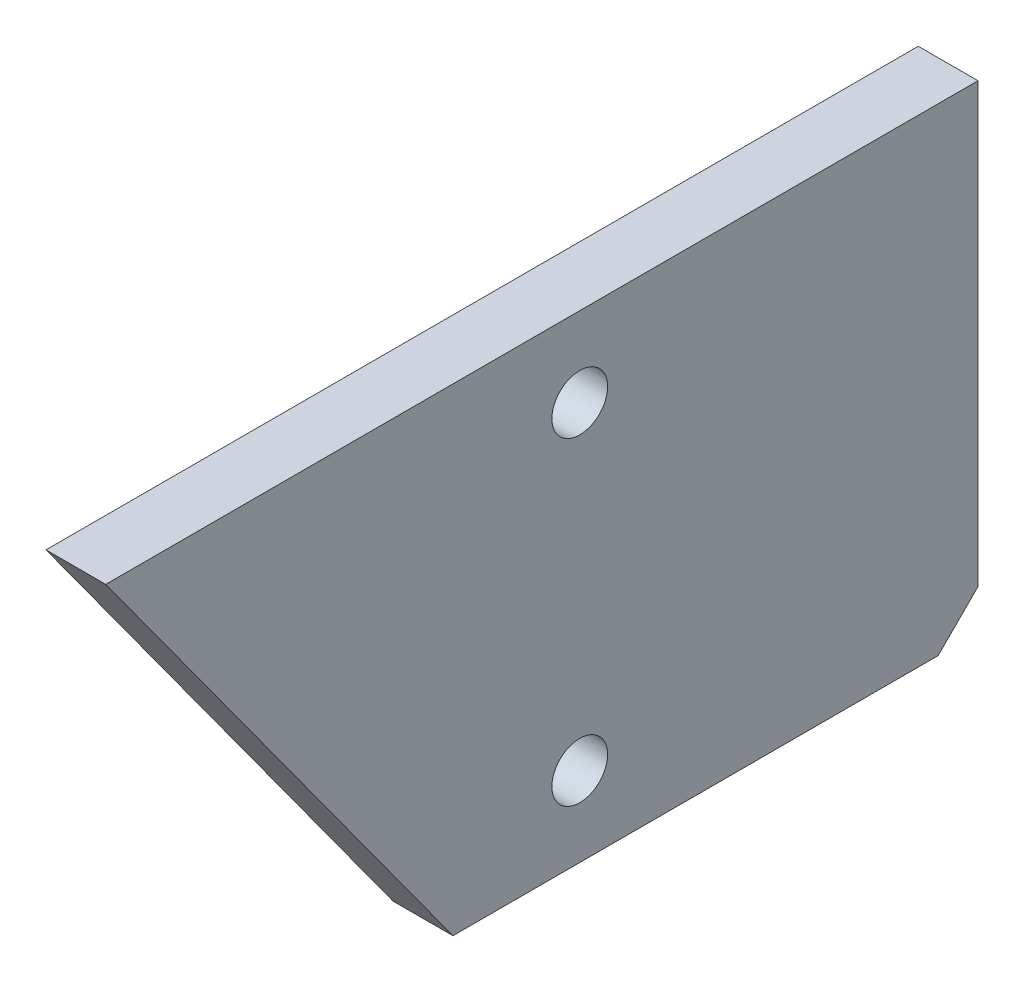
ISO-10303-21;
HEADER;
FILE_DESCRIPTION(('STEP AP214'),'2;1');
FILE_NAME('part.step','',(''),(''),'','','');
FILE_SCHEMA(('AUTOMOTIVE_DESIGN { 1 0 10303 214 1 1 1 1 }'));
ENDSEC;
DATA;
#1=APPLICATION_CONTEXT('core data for automotive mechanical design processes');
#2=APPLICATION_PROTOCOL_DEFINITION('international standard','automotive_design',2000,#1);
#3=PRODUCT_CONTEXT('',#1,'mechanical');
#4=PRODUCT('Part','Part','',(#3));
#5=PRODUCT_RELATED_PRODUCT_CATEGORY('part','',(#4));
#6=PRODUCT_DEFINITION_FORMATION('','',#4);
#7=PRODUCT_DEFINITION_CONTEXT('part definition',#1,'design');
#8=PRODUCT_DEFINITION('design','',#6,#7);
#9=PRODUCT_DEFINITION_SHAPE('','',#8);
#10=(LENGTH_UNIT() NAMED_UNIT(*) SI_UNIT(.MILLI.,.METRE.));
#11=(NAMED_UNIT(*) PLANE_ANGLE_UNIT() SI_UNIT($,.RADIAN.));
#12=(NAMED_UNIT(*) SI_UNIT($,.STERADIAN.) SOLID_ANGLE_UNIT());
#13=UNCERTAINTY_MEASURE_WITH_UNIT(LENGTH_MEASURE(1.E-05),#10,'distance_accuracy_value','');
#14=(GEOMETRIC_REPRESENTATION_CONTEXT(3) GLOBAL_UNCERTAINTY_ASSIGNED_CONTEXT((#13)) GLOBAL_UNIT_ASSIGNED_CONTEXT((#10,
#11,#12)) REPRESENTATION_CONTEXT('',''));
#15=CARTESIAN_POINT('',(0.,0.,0.));
#16=DIRECTION('',(0.,0.,1.));
#17=DIRECTION('',(1.,0.,0.));
#18=AXIS2_PLACEMENT_3D('',#15,#16,#17);
#19=CARTESIAN_POINT('',(-10.0000000000026,6.66133814775094E-13,220.));
#20=DIRECTION('',(0.,1.,0.));
#21=DIRECTION('',(0.,0.,-1.));
#22=AXIS2_PLACEMENT_3D('',#19,#20,#21);
#23=PLANE('',#22);
#24=DIRECTION('',(1.,0.,0.));
#25=VECTOR('',#24,1.);
#26=CARTESIAN_POINT('',(-10.0000000000002,6.66133814775094E-13,131.832212156129));
#27=LINE('',#26,#25);
#28=CARTESIAN_POINT('',(-25.0000000000026,6.57190314644052E-13,131.832212156129));
#29=VERTEX_POINT('',#28);
#30=CARTESIAN_POINT('',(-10.0000000000002,6.66133814775094E-13,131.832212156129));
#31=VERTEX_POINT('',#30);
#32=EDGE_CURVE('E11',#29,#31,#27,.T.);
#33=ORIENTED_EDGE('',*,*,#32,.F.);
#34=DIRECTION('',(0.,0.,-1.));
#35=VECTOR('',#34,1.);
#36=CARTESIAN_POINT('',(-25.0000000000026,6.62084610048779E-13,220.));
#37=LINE('',#36,#35);
#38=CARTESIAN_POINT('',(-25.0000000000027,0.,10.0000000000001));
#39=VERTEX_POINT('',#38);
#40=EDGE_CURVE('E95',#29,#39,#37,.T.);
#41=ORIENTED_EDGE('',*,*,#40,.T.);
#42=DIRECTION('',(1.,0.,0.));
#43=VECTOR('',#42,1.);
#44=CARTESIAN_POINT('',(-10.0000000000002,0.,10.0000000000002));
#45=LINE('',#44,#43);
#46=CARTESIAN_POINT('',(-10.0000000000002,0.,10.0000000000002));
#47=VERTEX_POINT('',#46);
#48=EDGE_CURVE('E47',#39,#47,#45,.T.);
#49=ORIENTED_EDGE('',*,*,#48,.T.);
#50=DIRECTION('',(0.,0.,-1.));
#51=VECTOR('',#50,1.);
#52=CARTESIAN_POINT('',(-10.0000000000026,6.66133814775094E-13,220.));
#53=LINE('',#52,#51);
#54=EDGE_CURVE('E117',#31,#47,#53,.T.);
#55=ORIENTED_EDGE('',*,*,#54,.F.);
#56=EDGE_LOOP('',(#33,#41,#49,#55));
#57=FACE_BOUND('',#56,.T.);
#58=ADVANCED_FACE('F37',(#57),#23,.F.);
#59=CARTESIAN_POINT('',(-10.0000000000002,0.,10.0000000000002));
#60=DIRECTION('',(0.,-0.707106781186533,-0.707106781186563));
#61=DIRECTION('',(0.,-0.707106781186573,0.707106781186543));
#62=AXIS2_PLACEMENT_3D('',#59,#60,#61);
#63=PLANE('',#62);
#64=ORIENTED_EDGE('',*,*,#48,.F.);
#65=DIRECTION('',(0.,-0.707106781186573,0.707106781186543));
#66=VECTOR('',#65,1.);
#67=CARTESIAN_POINT('',(-25.0000000000002,0.,10.0000000000002));
#68=LINE('',#67,#66);
#69=CARTESIAN_POINT('',(-25.0000000000027,10.,-1.11577413974828E-13));
#70=VERTEX_POINT('',#69);
#71=EDGE_CURVE('E108',#70,#39,#68,.T.);
#72=ORIENTED_EDGE('',*,*,#71,.F.);
#73=DIRECTION('',(1.,0.,0.));
#74=VECTOR('',#73,1.);
#75=CARTESIAN_POINT('',(-10.0000000000002,10.,0.));
#76=LINE('',#75,#74);
#77=CARTESIAN_POINT('',(-10.0000000000002,10.,0.));
#78=VERTEX_POINT('',#77);
#79=EDGE_CURVE('E112',#70,#78,#76,.T.);
#80=ORIENTED_EDGE('',*,*,#79,.T.);
#81=DIRECTION('',(0.,-0.707106781186573,0.707106781186543));
#82=VECTOR('',#81,1.);
#83=CARTESIAN_POINT('',(-10.0000000000002,0.,10.0000000000002));
#84=LINE('',#83,#82);
#85=EDGE_CURVE('E125',#78,#47,#84,.T.);
#86=ORIENTED_EDGE('',*,*,#85,.T.);
#87=EDGE_LOOP('',(#64,#72,#80,#86));
#88=FACE_BOUND('',#87,.T.);
#89=ADVANCED_FACE('F127',(#88),#63,.T.);
#90=CARTESIAN_POINT('',(-10.0000000000002,0.,0.));
#91=DIRECTION('',(0.,0.,-1.));
#92=DIRECTION('',(0.,-1.00000000000004,0.));
#93=AXIS2_PLACEMENT_3D('',#90,#91,#92);
#94=PLANE('',#93);
#95=ORIENTED_EDGE('',*,*,#79,.F.);
#96=DIRECTION('',(0.,-1.,0.));
#97=VECTOR('',#96,1.);
#98=CARTESIAN_POINT('',(-25.0000000000027,6.44977861373177E-13,2.77555756156289E-13));
#99=LINE('',#98,#97);
#100=CARTESIAN_POINT('',(-25.0000000000027,120.000000000004,2.70894418008538E-13));
#101=VERTEX_POINT('',#100);
#102=EDGE_CURVE('E105',#101,#70,#99,.T.);
#103=ORIENTED_EDGE('',*,*,#102,.F.);
#104=DIRECTION('',(1.,0.,0.));
#105=VECTOR('',#104,1.);
#106=CARTESIAN_POINT('',(-10.0000000000002,120.000000000004,3.88578058618805E-13));
#107=LINE('',#106,#105);
#108=CARTESIAN_POINT('',(-10.0000000000002,120.000000000004,3.88578058618805E-13));
#109=VERTEX_POINT('',#108);
#110=EDGE_CURVE('E55',#101,#109,#107,.T.);
#111=ORIENTED_EDGE('',*,*,#110,.T.);
#112=DIRECTION('',(0.,-1.00000000000004,0.));
#113=VECTOR('',#112,1.);
#114=CARTESIAN_POINT('',(-10.0000000000002,0.,0.));
#115=LINE('',#114,#113);
#116=EDGE_CURVE('E88',#109,#78,#115,.T.);
#117=ORIENTED_EDGE('',*,*,#116,.T.);
#118=EDGE_LOOP('',(#95,#103,#111,#117));
#119=FACE_BOUND('',#118,.T.);
#120=ADVANCED_FACE('F147',(#119),#94,.T.);
#121=CARTESIAN_POINT('',(-10.0000000000026,120.000000000005,220.000000000001));
#122=DIRECTION('',(0.,1.,0.));
#123=DIRECTION('',(0.,0.,-1.));
#124=AXIS2_PLACEMENT_3D('',#121,#122,#123);
#125=PLANE('',#124);
#126=ORIENTED_EDGE('',*,*,#110,.F.);
#127=DIRECTION('',(0.,0.,-1.));
#128=VECTOR('',#127,1.);
#129=CARTESIAN_POINT('',(-25.0000000000026,120.000000000006,220.));
#130=LINE('',#129,#128);
#131=CARTESIAN_POINT('',(-25.0000000000026,120.000000000006,219.017315516773));
#132=VERTEX_POINT('',#131);
#133=EDGE_CURVE('E93',#132,#101,#130,.T.);
#134=ORIENTED_EDGE('',*,*,#133,.F.);
#135=DIRECTION('',(1.,0.,0.));
#136=VECTOR('',#135,1.);
#137=CARTESIAN_POINT('',(-10.0000000000026,120.000000000006,219.017315516773));
#138=LINE('',#137,#136);
#139=CARTESIAN_POINT('',(-10.0000000000026,120.000000000006,219.017315516773));
#140=VERTEX_POINT('',#139);
#141=EDGE_CURVE('E41',#132,#140,#138,.T.);
#142=ORIENTED_EDGE('',*,*,#141,.T.);
#143=DIRECTION('',(0.,0.,-1.));
#144=VECTOR('',#143,1.);
#145=CARTESIAN_POINT('',(-10.0000000000026,120.000000000005,220.000000000001));
#146=LINE('',#145,#144);
#147=EDGE_CURVE('E161',#140,#109,#146,.T.);
#148=ORIENTED_EDGE('',*,*,#147,.T.);
#149=EDGE_LOOP('',(#126,#134,#142,#148));
#150=FACE_BOUND('',#149,.T.);
#151=ADVANCED_FACE('F97',(#150),#125,.T.);
#152=CARTESIAN_POINT('',(-10.0000000000018,100.000000000004,100.));
#153=DIRECTION('',(-1.,0.,0.));
#154=DIRECTION('',(0.,-1.,0.));
#155=AXIS2_PLACEMENT_3D('',#152,#153,#154);
#156=CYLINDRICAL_SURFACE('',#155,7.00000000000002);
#157=CARTESIAN_POINT('',(-10.0000000000018,100.000000000004,100.));
#158=DIRECTION('',(1.,0.,0.));
#159=DIRECTION('',(0.,0.,-1.));
#160=AXIS2_PLACEMENT_3D('',#157,#158,#159);
#161=CIRCLE('',#160,7.00000000000002);
#162=CARTESIAN_POINT('',(-10.0000000000018,100.000000000004,93.0000000000003));
#163=VERTEX_POINT('',#162);
#164=EDGE_CURVE('E107',#163,#163,#161,.T.);
#165=ORIENTED_EDGE('',*,*,#164,.T.);
#166=EDGE_LOOP('',(#165));
#167=FACE_BOUND('',#166,.T.);
#168=CARTESIAN_POINT('',(-25.0000000000018,100.000000000004,100.));
#169=DIRECTION('',(1.,0.,0.));
#170=DIRECTION('',(0.,1.,0.));
#171=AXIS2_PLACEMENT_3D('',#168,#169,#170);
#172=CIRCLE('',#171,7.00000000000002);
#173=CARTESIAN_POINT('',(-25.0000000000018,107.000000000004,100.));
#174=VERTEX_POINT('',#173);
#175=EDGE_CURVE('E101',#174,#174,#172,.T.);
#176=ORIENTED_EDGE('',*,*,#175,.F.);
#177=EDGE_LOOP('',(#176));
#178=FACE_BOUND('',#177,.T.);
#179=ADVANCED_FACE('F136',(#167,#178),#156,.F.);
#180=CARTESIAN_POINT('',(-10.0000000000002,20.0000000000014,99.9999999999999));
#181=DIRECTION('',(-1.,0.,0.));
#182=DIRECTION('',(0.,-1.,0.));
#183=AXIS2_PLACEMENT_3D('',#180,#181,#182);
#184=CYLINDRICAL_SURFACE('',#183,7.00000000000002);
#185=CARTESIAN_POINT('',(-10.0000000000002,20.0000000000014,99.9999999999999));
#186=DIRECTION('',(1.,0.,0.));
#187=DIRECTION('',(0.,0.,-1.));
#188=AXIS2_PLACEMENT_3D('',#185,#186,#187);
#189=CIRCLE('',#188,7.00000000000002);
#190=CARTESIAN_POINT('',(-10.0000000000002,20.0000000000014,92.9999999999998));
#191=VERTEX_POINT('',#190);
#192=EDGE_CURVE('E163',#191,#191,#189,.T.);
#193=ORIENTED_EDGE('',*,*,#192,.T.);
#194=EDGE_LOOP('',(#193));
#195=FACE_BOUND('',#194,.T.);
#196=CARTESIAN_POINT('',(-25.0000000000002,20.0000000000013,99.9999999999999));
#197=DIRECTION('',(1.,0.,0.));
#198=DIRECTION('',(0.,1.,0.));
#199=AXIS2_PLACEMENT_3D('',#196,#197,#198);
#200=CIRCLE('',#199,7.00000000000002);
#201=CARTESIAN_POINT('',(-25.0000000000002,27.0000000000014,99.9999999999999));
#202=VERTEX_POINT('',#201);
#203=EDGE_CURVE('E98',#202,#202,#200,.T.);
#204=ORIENTED_EDGE('',*,*,#203,.F.);
#205=EDGE_LOOP('',(#204));
#206=FACE_BOUND('',#205,.T.);
#207=ADVANCED_FACE('F138',(#195,#206),#184,.F.);
#208=CARTESIAN_POINT('',(-10.0000000000002,41.9262745781226,162.293433677964));
#209=DIRECTION('',(0.,0.587785252292458,-0.809016994374959));
#210=DIRECTION('',(0.,-0.809016994374982,-0.587785252292475));
#211=AXIS2_PLACEMENT_3D('',#208,#209,#210);
#212=PLANE('',#211);
#213=DIRECTION('',(0.,-0.809016994374982,-0.587785252292475));
#214=VECTOR('',#213,1.);
#215=CARTESIAN_POINT('',(-25.0000000000002,41.9262745781226,162.293433677964));
#216=LINE('',#215,#214);
#217=EDGE_CURVE('E82',#132,#29,#216,.T.);
#218=ORIENTED_EDGE('',*,*,#217,.T.);
#219=ORIENTED_EDGE('',*,*,#32,.T.);
#220=DIRECTION('',(0.,-0.809016994374982,-0.587785252292475));
#221=VECTOR('',#220,1.);
#222=CARTESIAN_POINT('',(-10.0000000000002,41.9262745781226,162.293433677964));
#223=LINE('',#222,#221);
#224=EDGE_CURVE('E84',#140,#31,#223,.T.);
#225=ORIENTED_EDGE('',*,*,#224,.F.);
#226=ORIENTED_EDGE('',*,*,#141,.F.);
#227=EDGE_LOOP('',(#218,#219,#225,#226));
#228=FACE_BOUND('',#227,.T.);
#229=ADVANCED_FACE('F39',(#228),#212,.F.);
#230=CARTESIAN_POINT('',(-10.0000000000026,6.66133814775094E-13,220.));
#231=DIRECTION('',(-1.,0.,0.));
#232=DIRECTION('',(0.,0.,-1.));
#233=AXIS2_PLACEMENT_3D('',#230,#231,#232);
#234=PLANE('',#233);
#235=ORIENTED_EDGE('',*,*,#164,.F.);
#236=EDGE_LOOP('',(#235));
#237=FACE_BOUND('',#236,.T.);
#238=ORIENTED_EDGE('',*,*,#192,.F.);
#239=EDGE_LOOP('',(#238));
#240=FACE_BOUND('',#239,.T.);
#241=ORIENTED_EDGE('',*,*,#147,.F.);
#242=ORIENTED_EDGE('',*,*,#224,.T.);
#243=ORIENTED_EDGE('',*,*,#54,.T.);
#244=ORIENTED_EDGE('',*,*,#85,.F.);
#245=ORIENTED_EDGE('',*,*,#116,.F.);
#246=EDGE_LOOP('',(#241,#242,#243,#244,#245));
#247=FACE_BOUND('',#246,.T.);
#248=ADVANCED_FACE('F123',(#237,#240,#247),#234,.F.);
#249=CARTESIAN_POINT('',(-25.0000000000026,6.57190314644053E-13,220.));
#250=DIRECTION('',(-1.,0.,0.));
#251=DIRECTION('',(0.,0.,-1.));
#252=AXIS2_PLACEMENT_3D('',#249,#250,#251);
#253=PLANE('',#252);
#254=ORIENTED_EDGE('',*,*,#175,.T.);
#255=EDGE_LOOP('',(#254));
#256=FACE_BOUND('',#255,.T.);
#257=ORIENTED_EDGE('',*,*,#203,.T.);
#258=EDGE_LOOP('',(#257));
#259=FACE_BOUND('',#258,.T.);
#260=ORIENTED_EDGE('',*,*,#133,.T.);
#261=ORIENTED_EDGE('',*,*,#102,.T.);
#262=ORIENTED_EDGE('',*,*,#71,.T.);
#263=ORIENTED_EDGE('',*,*,#40,.F.);
#264=ORIENTED_EDGE('',*,*,#217,.F.);
#265=EDGE_LOOP('',(#260,#261,#262,#263,#264));
#266=FACE_BOUND('',#265,.T.);
#267=ADVANCED_FACE('F91',(#256,#259,#266),#253,.T.);
#268=CLOSED_SHELL('',(#58,#89,#120,#151,#179,#207,#229,#248,#267));
#269=MANIFOLD_SOLID_BREP('B2',#268);
#270=ADVANCED_BREP_SHAPE_REPRESENTATION('',(#18,#269),#14);
#271=SHAPE_DEFINITION_REPRESENTATION(#9,#270);
ENDSEC;
END-ISO-10303-21;
